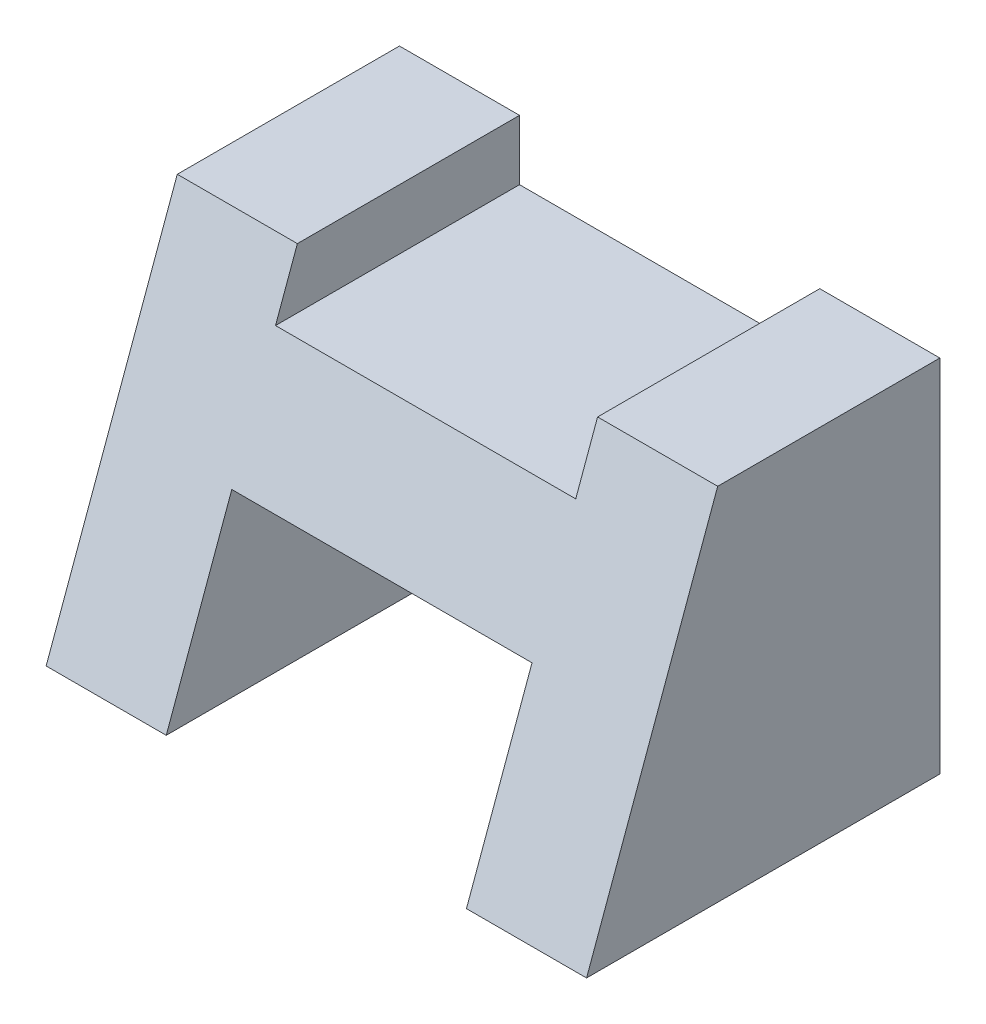
ISO-10303-21;
HEADER;
FILE_DESCRIPTION(('STEP AP214'),'2;1');
FILE_NAME('part.step','',(''),(''),'','','');
FILE_SCHEMA(('AUTOMOTIVE_DESIGN { 1 0 10303 214 1 1 1 1 }'));
ENDSEC;
DATA;
#1=APPLICATION_CONTEXT('core data for automotive mechanical design processes');
#2=APPLICATION_PROTOCOL_DEFINITION('international standard','automotive_design',2000,#1);
#3=PRODUCT_CONTEXT('',#1,'mechanical');
#4=PRODUCT('Part','Part','',(#3));
#5=PRODUCT_RELATED_PRODUCT_CATEGORY('part','',(#4));
#6=PRODUCT_DEFINITION_FORMATION('','',#4);
#7=PRODUCT_DEFINITION_CONTEXT('part definition',#1,'design');
#8=PRODUCT_DEFINITION('design','',#6,#7);
#9=PRODUCT_DEFINITION_SHAPE('','',#8);
#10=(LENGTH_UNIT() NAMED_UNIT(*) SI_UNIT(.MILLI.,.METRE.));
#11=(NAMED_UNIT(*) PLANE_ANGLE_UNIT() SI_UNIT($,.RADIAN.));
#12=(NAMED_UNIT(*) SI_UNIT($,.STERADIAN.) SOLID_ANGLE_UNIT());
#13=UNCERTAINTY_MEASURE_WITH_UNIT(LENGTH_MEASURE(1.E-05),#10,'distance_accuracy_value','');
#14=(GEOMETRIC_REPRESENTATION_CONTEXT(3) GLOBAL_UNCERTAINTY_ASSIGNED_CONTEXT((#13)) GLOBAL_UNIT_ASSIGNED_CONTEXT((#10,
#11,#12)) REPRESENTATION_CONTEXT('',''));
#15=CARTESIAN_POINT('',(0.,0.,0.));
#16=DIRECTION('',(0.,0.,1.));
#17=DIRECTION('',(1.,0.,0.));
#18=AXIS2_PLACEMENT_3D('',#15,#16,#17);
#19=CARTESIAN_POINT('',(0.,6.,6.));
#20=DIRECTION('',(0.,1.,0.));
#21=DIRECTION('',(0.,0.,1.));
#22=AXIS2_PLACEMENT_3D('',#19,#20,#21);
#23=PLANE('',#22);
#24=DIRECTION('',(1.,0.,0.));
#25=VECTOR('',#24,1.);
#26=CARTESIAN_POINT('',(0.,6.,3.69999999999996));
#27=LINE('',#26,#25);
#28=CARTESIAN_POINT('',(0.,6.,3.69999999999996));
#29=VERTEX_POINT('',#28);
#30=CARTESIAN_POINT('',(2.,6.,3.69999999999996));
#31=VERTEX_POINT('',#30);
#32=EDGE_CURVE('E197',#29,#31,#27,.T.);
#33=ORIENTED_EDGE('',*,*,#32,.T.);
#34=DIRECTION('',(0.,0.,-1.));
#35=VECTOR('',#34,1.);
#36=CARTESIAN_POINT('',(2.,6.,0.));
#37=LINE('',#36,#35);
#38=CARTESIAN_POINT('',(2.,6.,0.));
#39=VERTEX_POINT('',#38);
#40=EDGE_CURVE('E150',#31,#39,#37,.T.);
#41=ORIENTED_EDGE('',*,*,#40,.T.);
#42=DIRECTION('',(1.,0.,0.));
#43=VECTOR('',#42,1.);
#44=CARTESIAN_POINT('',(0.,6.,0.));
#45=LINE('',#44,#43);
#46=CARTESIAN_POINT('',(0.,6.,0.));
#47=VERTEX_POINT('',#46);
#48=EDGE_CURVE('E182',#47,#39,#45,.T.);
#49=ORIENTED_EDGE('',*,*,#48,.F.);
#50=DIRECTION('',(0.,0.,-1.));
#51=VECTOR('',#50,1.);
#52=CARTESIAN_POINT('',(0.,6.,6.));
#53=LINE('',#52,#51);
#54=EDGE_CURVE('E194',#29,#47,#53,.T.);
#55=ORIENTED_EDGE('',*,*,#54,.F.);
#56=EDGE_LOOP('',(#33,#41,#49,#55));
#57=FACE_BOUND('',#56,.T.);
#58=ADVANCED_FACE('F37',(#57),#23,.T.);
#59=CARTESIAN_POINT('',(0.,0.,0.));
#60=DIRECTION('',(0.,0.,1.));
#61=DIRECTION('',(1.,0.,0.));
#62=AXIS2_PLACEMENT_3D('',#59,#60,#61);
#63=PLANE('',#62);
#64=DIRECTION('',(0.,1.,0.));
#65=VECTOR('',#64,1.);
#66=CARTESIAN_POINT('',(2.,5.,0.));
#67=LINE('',#66,#65);
#68=CARTESIAN_POINT('',(2.,5.,0.));
#69=VERTEX_POINT('',#68);
#70=EDGE_CURVE('E143',#69,#39,#67,.T.);
#71=ORIENTED_EDGE('',*,*,#70,.F.);
#72=DIRECTION('',(-1.,0.,0.));
#73=VECTOR('',#72,1.);
#74=CARTESIAN_POINT('',(0.,5.,0.));
#75=LINE('',#74,#73);
#76=CARTESIAN_POINT('',(7.,5.,0.));
#77=VERTEX_POINT('',#76);
#78=EDGE_CURVE('E129',#77,#69,#75,.T.);
#79=ORIENTED_EDGE('',*,*,#78,.F.);
#80=DIRECTION('',(0.,1.,0.));
#81=VECTOR('',#80,1.);
#82=CARTESIAN_POINT('',(7.,5.,0.));
#83=LINE('',#82,#81);
#84=CARTESIAN_POINT('',(7.,6.,0.));
#85=VERTEX_POINT('',#84);
#86=EDGE_CURVE('E137',#77,#85,#83,.T.);
#87=ORIENTED_EDGE('',*,*,#86,.T.);
#88=CARTESIAN_POINT('',(9.,6.,0.));
#89=VERTEX_POINT('',#88);
#90=EDGE_CURVE('E181',#85,#89,#45,.T.);
#91=ORIENTED_EDGE('',*,*,#90,.T.);
#92=DIRECTION('',(0.,1.,0.));
#93=VECTOR('',#92,1.);
#94=CARTESIAN_POINT('',(9.,0.,0.));
#95=LINE('',#94,#93);
#96=CARTESIAN_POINT('',(9.,0.,0.));
#97=VERTEX_POINT('',#96);
#98=EDGE_CURVE('E161',#97,#89,#95,.T.);
#99=ORIENTED_EDGE('',*,*,#98,.F.);
#100=DIRECTION('',(1.,0.,0.));
#101=VECTOR('',#100,1.);
#102=CARTESIAN_POINT('',(0.,0.,0.));
#103=LINE('',#102,#101);
#104=CARTESIAN_POINT('',(7.,0.,0.));
#105=VERTEX_POINT('',#104);
#106=EDGE_CURVE('E158',#105,#97,#103,.T.);
#107=ORIENTED_EDGE('',*,*,#106,.F.);
#108=DIRECTION('',(0.,-1.,0.));
#109=VECTOR('',#108,1.);
#110=CARTESIAN_POINT('',(7.,0.,0.));
#111=LINE('',#110,#109);
#112=CARTESIAN_POINT('',(7.,3.,0.));
#113=VERTEX_POINT('',#112);
#114=EDGE_CURVE('E154',#113,#105,#111,.T.);
#115=ORIENTED_EDGE('',*,*,#114,.F.);
#116=DIRECTION('',(-1.,0.,0.));
#117=VECTOR('',#116,1.);
#118=CARTESIAN_POINT('',(7.,3.,0.));
#119=LINE('',#118,#117);
#120=CARTESIAN_POINT('',(2.,3.,0.));
#121=VERTEX_POINT('',#120);
#122=EDGE_CURVE('E174',#113,#121,#119,.T.);
#123=ORIENTED_EDGE('',*,*,#122,.T.);
#124=DIRECTION('',(0.,-1.,0.));
#125=VECTOR('',#124,1.);
#126=CARTESIAN_POINT('',(2.,0.,0.));
#127=LINE('',#126,#125);
#128=CARTESIAN_POINT('',(2.,0.,0.));
#129=VERTEX_POINT('',#128);
#130=EDGE_CURVE('E178',#121,#129,#127,.T.);
#131=ORIENTED_EDGE('',*,*,#130,.T.);
#132=DIRECTION('',(1.,0.,0.));
#133=VECTOR('',#132,1.);
#134=CARTESIAN_POINT('',(0.,0.,0.));
#135=LINE('',#134,#133);
#136=CARTESIAN_POINT('',(0.,0.,0.));
#137=VERTEX_POINT('',#136);
#138=EDGE_CURVE('E187',#137,#129,#135,.T.);
#139=ORIENTED_EDGE('',*,*,#138,.F.);
#140=DIRECTION('',(0.,1.,0.));
#141=VECTOR('',#140,1.);
#142=CARTESIAN_POINT('',(0.,0.,0.));
#143=LINE('',#142,#141);
#144=EDGE_CURVE('E184',#137,#47,#143,.T.);
#145=ORIENTED_EDGE('',*,*,#144,.T.);
#146=ORIENTED_EDGE('',*,*,#48,.T.);
#147=EDGE_LOOP('',(#71,#79,#87,#91,#99,#107,#115,#123,#131,#139,#145,#146));
#148=FACE_BOUND('',#147,.T.);
#149=ADVANCED_FACE('F145',(#148),#63,.F.);
#150=CARTESIAN_POINT('',(0.,6.,3.69999999999996));
#151=DIRECTION('',(0.,-0.342020143325665,-0.93969262078591));
#152=DIRECTION('',(1.,0.,0.));
#153=AXIS2_PLACEMENT_3D('',#150,#151,#152);
#154=PLANE('',#153);
#155=DIRECTION('',(1.,0.,0.));
#156=VECTOR('',#155,1.);
#157=CARTESIAN_POINT('',(0.,5.,4.06397023426615));
#158=LINE('',#157,#156);
#159=CARTESIAN_POINT('',(7.,5.,4.06397023426615));
#160=VERTEX_POINT('',#159);
#161=CARTESIAN_POINT('',(2.,5.,4.06397023426615));
#162=VERTEX_POINT('',#161);
#163=EDGE_CURVE('E132',#160,#162,#158,.F.);
#164=ORIENTED_EDGE('',*,*,#163,.T.);
#165=DIRECTION('',(0.,-0.93969262078591,0.342020143325665));
#166=VECTOR('',#165,1.);
#167=CARTESIAN_POINT('',(2.,6.,3.69999999999996));
#168=LINE('',#167,#166);
#169=EDGE_CURVE('E11',#162,#31,#168,.F.);
#170=ORIENTED_EDGE('',*,*,#169,.T.);
#171=ORIENTED_EDGE('',*,*,#32,.F.);
#172=DIRECTION('',(0.,-0.93969262078591,0.342020143325665));
#173=VECTOR('',#172,1.);
#174=CARTESIAN_POINT('',(0.,-0.0373390804964767,5.89741171947273));
#175=LINE('',#174,#173);
#176=CARTESIAN_POINT('',(0.,0.,5.88382140559714));
#177=VERTEX_POINT('',#176);
#178=EDGE_CURVE('E211',#177,#29,#175,.F.);
#179=ORIENTED_EDGE('',*,*,#178,.F.);
#180=DIRECTION('',(1.,0.,0.));
#181=VECTOR('',#180,1.);
#182=CARTESIAN_POINT('',(0.,0.,5.88382140559714));
#183=LINE('',#182,#181);
#184=CARTESIAN_POINT('',(2.,0.,5.88382140559714));
#185=VERTEX_POINT('',#184);
#186=EDGE_CURVE('E60',#185,#177,#183,.F.);
#187=ORIENTED_EDGE('',*,*,#186,.F.);
#188=DIRECTION('',(0.,0.93969262078591,-0.342020143325665));
#189=VECTOR('',#188,1.);
#190=CARTESIAN_POINT('',(2.,-0.0373390804964764,5.89741171947273));
#191=LINE('',#190,#189);
#192=CARTESIAN_POINT('',(2.,3.,4.79191070279855));
#193=VERTEX_POINT('',#192);
#194=EDGE_CURVE('E208',#193,#185,#191,.F.);
#195=ORIENTED_EDGE('',*,*,#194,.F.);
#196=DIRECTION('',(1.,0.,0.));
#197=VECTOR('',#196,1.);
#198=CARTESIAN_POINT('',(0.,3.,4.79191070279855));
#199=LINE('',#198,#197);
#200=CARTESIAN_POINT('',(7.,3.,4.79191070279855));
#201=VERTEX_POINT('',#200);
#202=EDGE_CURVE('E206',#201,#193,#199,.F.);
#203=ORIENTED_EDGE('',*,*,#202,.F.);
#204=DIRECTION('',(0.,-0.93969262078591,0.342020143325665));
#205=VECTOR('',#204,1.);
#206=CARTESIAN_POINT('',(7.,6.,3.69999999999996));
#207=LINE('',#206,#205);
#208=CARTESIAN_POINT('',(7.,0.,5.88382140559714));
#209=VERTEX_POINT('',#208);
#210=EDGE_CURVE('E204',#209,#201,#207,.F.);
#211=ORIENTED_EDGE('',*,*,#210,.F.);
#212=DIRECTION('',(1.,0.,0.));
#213=VECTOR('',#212,1.);
#214=CARTESIAN_POINT('',(0.,0.,5.88382140559714));
#215=LINE('',#214,#213);
#216=CARTESIAN_POINT('',(9.,0.,5.88382140559714));
#217=VERTEX_POINT('',#216);
#218=EDGE_CURVE('E202',#217,#209,#215,.F.);
#219=ORIENTED_EDGE('',*,*,#218,.F.);
#220=DIRECTION('',(0.,0.93969262078591,-0.342020143325665));
#221=VECTOR('',#220,1.);
#222=CARTESIAN_POINT('',(9.,6.,3.69999999999996));
#223=LINE('',#222,#221);
#224=CARTESIAN_POINT('',(9.,6.,3.69999999999996));
#225=VERTEX_POINT('',#224);
#226=EDGE_CURVE('E200',#225,#217,#223,.F.);
#227=ORIENTED_EDGE('',*,*,#226,.F.);
#228=CARTESIAN_POINT('',(7.,6.,3.69999999999996));
#229=VERTEX_POINT('',#228);
#230=EDGE_CURVE('E196',#229,#225,#27,.T.);
#231=ORIENTED_EDGE('',*,*,#230,.F.);
#232=DIRECTION('',(0.,-0.93969262078591,0.342020143325665));
#233=VECTOR('',#232,1.);
#234=CARTESIAN_POINT('',(7.,6.,3.69999999999996));
#235=LINE('',#234,#233);
#236=EDGE_CURVE('E45',#160,#229,#235,.F.);
#237=ORIENTED_EDGE('',*,*,#236,.F.);
#238=EDGE_LOOP('',(#164,#170,#171,#179,#187,#195,#203,#211,#219,#227,#231,#237));
#239=FACE_BOUND('',#238,.T.);
#240=ADVANCED_FACE('F39',(#239),#154,.F.);
#241=CARTESIAN_POINT('',(2.,0.,6.));
#242=DIRECTION('',(1.,0.,0.));
#243=DIRECTION('',(0.,1.,0.));
#244=AXIS2_PLACEMENT_3D('',#241,#242,#243);
#245=PLANE('',#244);
#246=DIRECTION('',(0.,0.,-1.));
#247=VECTOR('',#246,1.);
#248=CARTESIAN_POINT('',(2.,3.,0.));
#249=LINE('',#248,#247);
#250=EDGE_CURVE('E171',#193,#121,#249,.T.);
#251=ORIENTED_EDGE('',*,*,#250,.F.);
#252=ORIENTED_EDGE('',*,*,#194,.T.);
#253=DIRECTION('',(0.,0.,-1.));
#254=VECTOR('',#253,1.);
#255=CARTESIAN_POINT('',(2.,0.,6.));
#256=LINE('',#255,#254);
#257=EDGE_CURVE('E190',#185,#129,#256,.T.);
#258=ORIENTED_EDGE('',*,*,#257,.T.);
#259=ORIENTED_EDGE('',*,*,#130,.F.);
#260=EDGE_LOOP('',(#251,#252,#258,#259));
#261=FACE_BOUND('',#260,.T.);
#262=ADVANCED_FACE('F269',(#261),#245,.T.);
#263=DIRECTION('',(0.,0.,-1.));
#264=VECTOR('',#263,1.);
#265=CARTESIAN_POINT('',(7.,6.,0.));
#266=LINE('',#265,#264);
#267=EDGE_CURVE('E140',#229,#85,#266,.T.);
#268=ORIENTED_EDGE('',*,*,#267,.F.);
#269=ORIENTED_EDGE('',*,*,#230,.T.);
#270=DIRECTION('',(0.,0.,-1.));
#271=VECTOR('',#270,1.);
#272=CARTESIAN_POINT('',(9.,6.,6.));
#273=LINE('',#272,#271);
#274=EDGE_CURVE('E164',#225,#89,#273,.T.);
#275=ORIENTED_EDGE('',*,*,#274,.T.);
#276=ORIENTED_EDGE('',*,*,#90,.F.);
#277=EDGE_LOOP('',(#268,#269,#275,#276));
#278=FACE_BOUND('',#277,.T.);
#279=ADVANCED_FACE('F216',(#278),#23,.T.);
#280=CARTESIAN_POINT('',(0.,0.,6.));
#281=DIRECTION('',(-1.,0.,0.));
#282=DIRECTION('',(0.,0.,1.));
#283=AXIS2_PLACEMENT_3D('',#280,#281,#282);
#284=PLANE('',#283);
#285=DIRECTION('',(0.,0.,-1.));
#286=VECTOR('',#285,1.);
#287=CARTESIAN_POINT('',(0.,0.,6.));
#288=LINE('',#287,#286);
#289=EDGE_CURVE('E192',#177,#137,#288,.T.);
#290=ORIENTED_EDGE('',*,*,#289,.F.);
#291=ORIENTED_EDGE('',*,*,#178,.T.);
#292=ORIENTED_EDGE('',*,*,#54,.T.);
#293=ORIENTED_EDGE('',*,*,#144,.F.);
#294=EDGE_LOOP('',(#290,#291,#292,#293));
#295=FACE_BOUND('',#294,.T.);
#296=ADVANCED_FACE('F245',(#295),#284,.T.);
#297=CARTESIAN_POINT('',(0.,0.,6.));
#298=DIRECTION('',(0.,1.,0.));
#299=DIRECTION('',(0.,0.,1.));
#300=AXIS2_PLACEMENT_3D('',#297,#298,#299);
#301=PLANE('',#300);
#302=ORIENTED_EDGE('',*,*,#257,.F.);
#303=ORIENTED_EDGE('',*,*,#186,.T.);
#304=ORIENTED_EDGE('',*,*,#289,.T.);
#305=ORIENTED_EDGE('',*,*,#138,.T.);
#306=EDGE_LOOP('',(#302,#303,#304,#305));
#307=FACE_BOUND('',#306,.T.);
#308=ADVANCED_FACE('F242',(#307),#301,.F.);
#309=CARTESIAN_POINT('',(7.,3.,0.));
#310=DIRECTION('',(0.,1.,0.));
#311=DIRECTION('',(0.,0.,1.));
#312=AXIS2_PLACEMENT_3D('',#309,#310,#311);
#313=PLANE('',#312);
#314=DIRECTION('',(0.,0.,-1.));
#315=VECTOR('',#314,1.);
#316=CARTESIAN_POINT('',(7.,3.,0.));
#317=LINE('',#316,#315);
#318=EDGE_CURVE('E172',#201,#113,#317,.T.);
#319=ORIENTED_EDGE('',*,*,#318,.F.);
#320=ORIENTED_EDGE('',*,*,#202,.T.);
#321=ORIENTED_EDGE('',*,*,#250,.T.);
#322=ORIENTED_EDGE('',*,*,#122,.F.);
#323=EDGE_LOOP('',(#319,#320,#321,#322));
#324=FACE_BOUND('',#323,.T.);
#325=ADVANCED_FACE('F236',(#324),#313,.F.);
#326=CARTESIAN_POINT('',(7.,0.,6.));
#327=DIRECTION('',(1.,0.,0.));
#328=DIRECTION('',(0.,1.,0.));
#329=AXIS2_PLACEMENT_3D('',#326,#327,#328);
#330=PLANE('',#329);
#331=DIRECTION('',(0.,0.,-1.));
#332=VECTOR('',#331,1.);
#333=CARTESIAN_POINT('',(7.,0.,6.));
#334=LINE('',#333,#332);
#335=EDGE_CURVE('E169',#209,#105,#334,.T.);
#336=ORIENTED_EDGE('',*,*,#335,.F.);
#337=ORIENTED_EDGE('',*,*,#210,.T.);
#338=ORIENTED_EDGE('',*,*,#318,.T.);
#339=ORIENTED_EDGE('',*,*,#114,.T.);
#340=EDGE_LOOP('',(#336,#337,#338,#339));
#341=FACE_BOUND('',#340,.T.);
#342=ADVANCED_FACE('F231',(#341),#330,.F.);
#343=CARTESIAN_POINT('',(0.,0.,6.));
#344=DIRECTION('',(0.,1.,0.));
#345=DIRECTION('',(0.,0.,1.));
#346=AXIS2_PLACEMENT_3D('',#343,#344,#345);
#347=PLANE('',#346);
#348=DIRECTION('',(0.,0.,-1.));
#349=VECTOR('',#348,1.);
#350=CARTESIAN_POINT('',(9.,0.,6.));
#351=LINE('',#350,#349);
#352=EDGE_CURVE('E167',#217,#97,#351,.T.);
#353=ORIENTED_EDGE('',*,*,#352,.F.);
#354=ORIENTED_EDGE('',*,*,#218,.T.);
#355=ORIENTED_EDGE('',*,*,#335,.T.);
#356=ORIENTED_EDGE('',*,*,#106,.T.);
#357=EDGE_LOOP('',(#353,#354,#355,#356));
#358=FACE_BOUND('',#357,.T.);
#359=ADVANCED_FACE('F228',(#358),#347,.F.);
#360=CARTESIAN_POINT('',(9.,0.,6.));
#361=DIRECTION('',(-1.,0.,0.));
#362=DIRECTION('',(0.,0.,1.));
#363=AXIS2_PLACEMENT_3D('',#360,#361,#362);
#364=PLANE('',#363);
#365=ORIENTED_EDGE('',*,*,#274,.F.);
#366=ORIENTED_EDGE('',*,*,#226,.T.);
#367=ORIENTED_EDGE('',*,*,#352,.T.);
#368=ORIENTED_EDGE('',*,*,#98,.T.);
#369=EDGE_LOOP('',(#365,#366,#367,#368));
#370=FACE_BOUND('',#369,.T.);
#371=ADVANCED_FACE('F223',(#370),#364,.F.);
#372=CARTESIAN_POINT('',(2.,5.,0.));
#373=DIRECTION('',(1.,0.,0.));
#374=DIRECTION('',(0.,0.,-1.));
#375=AXIS2_PLACEMENT_3D('',#372,#373,#374);
#376=PLANE('',#375);
#377=DIRECTION('',(0.,0.,-1.));
#378=VECTOR('',#377,1.);
#379=CARTESIAN_POINT('',(2.,5.,0.));
#380=LINE('',#379,#378);
#381=EDGE_CURVE('E52',#162,#69,#380,.T.);
#382=ORIENTED_EDGE('',*,*,#381,.T.);
#383=ORIENTED_EDGE('',*,*,#70,.T.);
#384=ORIENTED_EDGE('',*,*,#40,.F.);
#385=ORIENTED_EDGE('',*,*,#169,.F.);
#386=EDGE_LOOP('',(#382,#383,#384,#385));
#387=FACE_BOUND('',#386,.T.);
#388=ADVANCED_FACE('F252',(#387),#376,.T.);
#389=CARTESIAN_POINT('',(7.,5.,0.));
#390=DIRECTION('',(1.,0.,0.));
#391=DIRECTION('',(0.,0.,-1.));
#392=AXIS2_PLACEMENT_3D('',#389,#390,#391);
#393=PLANE('',#392);
#394=ORIENTED_EDGE('',*,*,#236,.T.);
#395=ORIENTED_EDGE('',*,*,#267,.T.);
#396=ORIENTED_EDGE('',*,*,#86,.F.);
#397=DIRECTION('',(0.,0.,-1.));
#398=VECTOR('',#397,1.);
#399=CARTESIAN_POINT('',(7.,5.,0.));
#400=LINE('',#399,#398);
#401=EDGE_CURVE('E125',#160,#77,#400,.T.);
#402=ORIENTED_EDGE('',*,*,#401,.F.);
#403=EDGE_LOOP('',(#394,#395,#396,#402));
#404=FACE_BOUND('',#403,.T.);
#405=ADVANCED_FACE('F138',(#404),#393,.F.);
#406=CARTESIAN_POINT('',(0.,5.,0.));
#407=DIRECTION('',(0.,1.,0.));
#408=DIRECTION('',(0.,0.,1.));
#409=AXIS2_PLACEMENT_3D('',#406,#407,#408);
#410=PLANE('',#409);
#411=ORIENTED_EDGE('',*,*,#401,.T.);
#412=ORIENTED_EDGE('',*,*,#78,.T.);
#413=ORIENTED_EDGE('',*,*,#381,.F.);
#414=ORIENTED_EDGE('',*,*,#163,.F.);
#415=EDGE_LOOP('',(#411,#412,#413,#414));
#416=FACE_BOUND('',#415,.T.);
#417=ADVANCED_FACE('F127',(#416),#410,.T.);
#418=CLOSED_SHELL('',(#58,#149,#240,#262,#279,#296,#308,#325,#342,#359,#371,#388,#405,#417));
#419=MANIFOLD_SOLID_BREP('B2',#418);
#420=ADVANCED_BREP_SHAPE_REPRESENTATION('',(#18,#419),#14);
#421=SHAPE_DEFINITION_REPRESENTATION(#9,#420);
ENDSEC;
END-ISO-10303-21;
